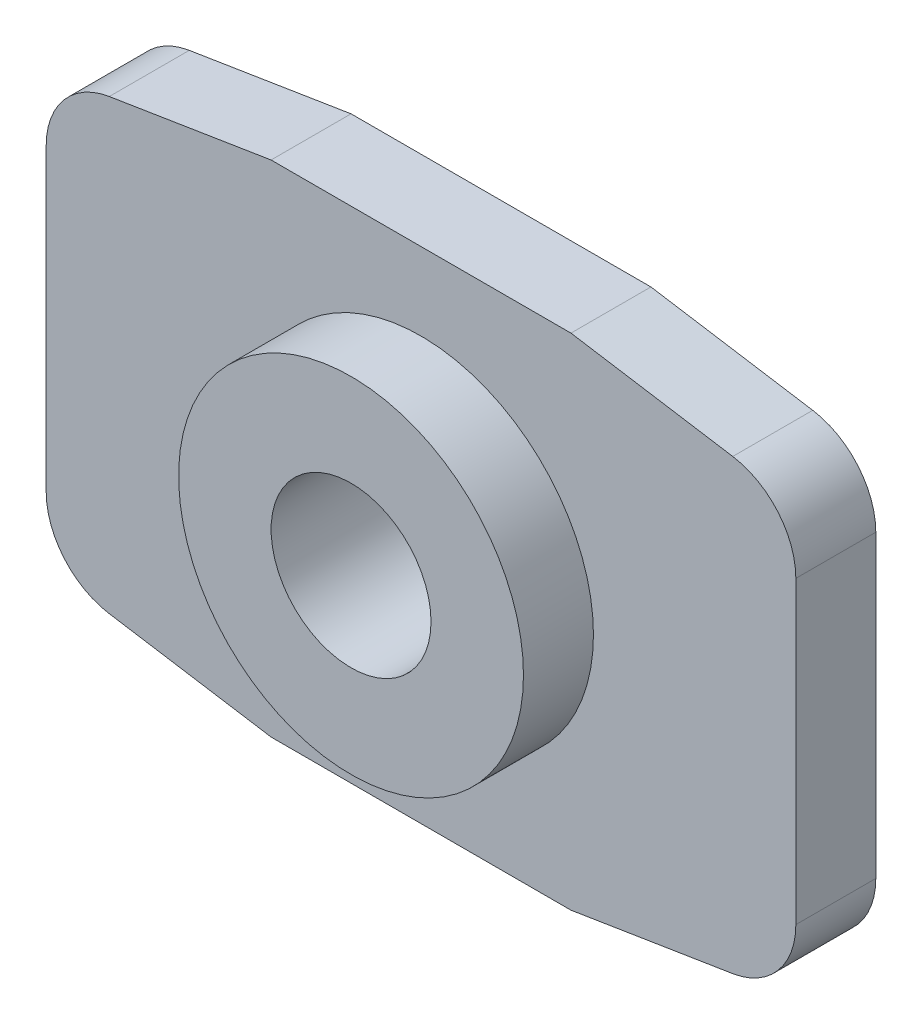
ISO-10303-21;
HEADER;
FILE_DESCRIPTION(('STEP AP214'),'2;1');
FILE_NAME('part.step','',(''),(''),'','','');
FILE_SCHEMA(('AUTOMOTIVE_DESIGN { 1 0 10303 214 1 1 1 1 }'));
ENDSEC;
DATA;
#1=APPLICATION_CONTEXT('core data for automotive mechanical design processes');
#2=APPLICATION_PROTOCOL_DEFINITION('international standard','automotive_design',2000,#1);
#3=PRODUCT_CONTEXT('',#1,'mechanical');
#4=PRODUCT('Part','Part','',(#3));
#5=PRODUCT_RELATED_PRODUCT_CATEGORY('part','',(#4));
#6=PRODUCT_DEFINITION_FORMATION('','',#4);
#7=PRODUCT_DEFINITION_CONTEXT('part definition',#1,'design');
#8=PRODUCT_DEFINITION('design','',#6,#7);
#9=PRODUCT_DEFINITION_SHAPE('','',#8);
#10=(LENGTH_UNIT() NAMED_UNIT(*) SI_UNIT(.MILLI.,.METRE.));
#11=(NAMED_UNIT(*) PLANE_ANGLE_UNIT() SI_UNIT($,.RADIAN.));
#12=(NAMED_UNIT(*) SI_UNIT($,.STERADIAN.) SOLID_ANGLE_UNIT());
#13=UNCERTAINTY_MEASURE_WITH_UNIT(LENGTH_MEASURE(1.E-05),#10,'distance_accuracy_value','');
#14=(GEOMETRIC_REPRESENTATION_CONTEXT(3) GLOBAL_UNCERTAINTY_ASSIGNED_CONTEXT((#13)) GLOBAL_UNIT_ASSIGNED_CONTEXT((#10,
#11,#12)) REPRESENTATION_CONTEXT('',''));
#15=CARTESIAN_POINT('',(0.,0.,0.));
#16=DIRECTION('',(0.,0.,1.));
#17=DIRECTION('',(1.,0.,0.));
#18=AXIS2_PLACEMENT_3D('',#15,#16,#17);
#19=CARTESIAN_POINT('',(6.,3.,1.6));
#20=DIRECTION('',(0.,0.,1.));
#21=DIRECTION('',(1.,0.,0.));
#22=AXIS2_PLACEMENT_3D('',#19,#20,#21);
#23=PLANE('',#22);
#24=CARTESIAN_POINT('',(6.,3.,1.6));
#25=DIRECTION('',(0.,0.,1.));
#26=DIRECTION('',(1.,0.,0.));
#27=AXIS2_PLACEMENT_3D('',#24,#25,#26);
#28=CIRCLE('',#27,1.5);
#29=CARTESIAN_POINT('',(7.5,3.,1.6));
#30=VERTEX_POINT('',#29);
#31=CARTESIAN_POINT('',(6.23739675280407,4.48109512920611,1.6));
#32=VERTEX_POINT('',#31);
#33=EDGE_CURVE('E199',#30,#32,#28,.T.);
#34=ORIENTED_EDGE('',*,*,#33,.T.);
#35=DIRECTION('',(-0.987396752804077,0.158264501869385,0.));
#36=VECTOR('',#35,1.);
#37=CARTESIAN_POINT('',(6.23739675280407,4.48109512920611,1.6));
#38=LINE('',#37,#36);
#39=CARTESIAN_POINT('',(3.,5.,1.6));
#40=VERTEX_POINT('',#39);
#41=EDGE_CURVE('E108',#32,#40,#38,.T.);
#42=ORIENTED_EDGE('',*,*,#41,.T.);
#43=DIRECTION('',(-1.,0.,0.));
#44=VECTOR('',#43,1.);
#45=CARTESIAN_POINT('',(-3.,5.,1.6));
#46=LINE('',#45,#44);
#47=CARTESIAN_POINT('',(-3.,5.,1.6));
#48=VERTEX_POINT('',#47);
#49=EDGE_CURVE('E238',#40,#48,#46,.T.);
#50=ORIENTED_EDGE('',*,*,#49,.T.);
#51=DIRECTION('',(-0.987396752804077,-0.158264501869386,0.));
#52=VECTOR('',#51,1.);
#53=CARTESIAN_POINT('',(-6.23739675280407,4.48109512920611,1.6));
#54=LINE('',#53,#52);
#55=CARTESIAN_POINT('',(-6.23739675280407,4.48109512920611,1.6));
#56=VERTEX_POINT('',#55);
#57=EDGE_CURVE('E257',#48,#56,#54,.T.);
#58=ORIENTED_EDGE('',*,*,#57,.T.);
#59=CARTESIAN_POINT('',(-6.,3.,1.6));
#60=DIRECTION('',(0.,0.,1.));
#61=DIRECTION('',(-1.,0.,0.));
#62=AXIS2_PLACEMENT_3D('',#59,#60,#61);
#63=CIRCLE('',#62,1.5);
#64=CARTESIAN_POINT('',(-7.5,3.,1.6));
#65=VERTEX_POINT('',#64);
#66=EDGE_CURVE('E253',#56,#65,#63,.T.);
#67=ORIENTED_EDGE('',*,*,#66,.T.);
#68=DIRECTION('',(0.,-1.,0.));
#69=VECTOR('',#68,1.);
#70=CARTESIAN_POINT('',(-7.5,-3.,1.6));
#71=LINE('',#70,#69);
#72=CARTESIAN_POINT('',(-7.5,-3.,1.6));
#73=VERTEX_POINT('',#72);
#74=EDGE_CURVE('E256',#65,#73,#71,.T.);
#75=ORIENTED_EDGE('',*,*,#74,.T.);
#76=CARTESIAN_POINT('',(-6.,-3.,1.6));
#77=DIRECTION('',(0.,0.,1.));
#78=DIRECTION('',(1.,0.,0.));
#79=AXIS2_PLACEMENT_3D('',#76,#77,#78);
#80=CIRCLE('',#79,1.5);
#81=CARTESIAN_POINT('',(-6.23739675280407,-4.48109512920612,1.6));
#82=VERTEX_POINT('',#81);
#83=EDGE_CURVE('E262',#73,#82,#80,.T.);
#84=ORIENTED_EDGE('',*,*,#83,.T.);
#85=DIRECTION('',(0.987396752804077,-0.158264501869385,0.));
#86=VECTOR('',#85,1.);
#87=CARTESIAN_POINT('',(-6.23739675280407,-4.48109512920612,1.6));
#88=LINE('',#87,#86);
#89=CARTESIAN_POINT('',(-3.,-5.,1.6));
#90=VERTEX_POINT('',#89);
#91=EDGE_CURVE('E270',#82,#90,#88,.T.);
#92=ORIENTED_EDGE('',*,*,#91,.T.);
#93=DIRECTION('',(1.,0.,0.));
#94=VECTOR('',#93,1.);
#95=CARTESIAN_POINT('',(-3.,-5.,1.6));
#96=LINE('',#95,#94);
#97=CARTESIAN_POINT('',(3.,-5.,1.6));
#98=VERTEX_POINT('',#97);
#99=EDGE_CURVE('E139',#90,#98,#96,.T.);
#100=ORIENTED_EDGE('',*,*,#99,.T.);
#101=DIRECTION('',(0.987396752804077,0.158264501869385,0.));
#102=VECTOR('',#101,1.);
#103=CARTESIAN_POINT('',(6.23739675280407,-4.48109512920611,1.6));
#104=LINE('',#103,#102);
#105=CARTESIAN_POINT('',(6.23739675280407,-4.48109512920612,1.6));
#106=VERTEX_POINT('',#105);
#107=EDGE_CURVE('E133',#98,#106,#104,.T.);
#108=ORIENTED_EDGE('',*,*,#107,.T.);
#109=CARTESIAN_POINT('',(6.,-3.,1.6));
#110=DIRECTION('',(0.,0.,1.));
#111=DIRECTION('',(-1.,0.,0.));
#112=AXIS2_PLACEMENT_3D('',#109,#110,#111);
#113=CIRCLE('',#112,1.5);
#114=CARTESIAN_POINT('',(7.5,-3.,1.6));
#115=VERTEX_POINT('',#114);
#116=EDGE_CURVE('E137',#106,#115,#113,.T.);
#117=ORIENTED_EDGE('',*,*,#116,.T.);
#118=DIRECTION('',(0.,1.,0.));
#119=VECTOR('',#118,1.);
#120=CARTESIAN_POINT('',(7.5,-3.,1.6));
#121=LINE('',#120,#119);
#122=EDGE_CURVE('E53',#115,#30,#121,.T.);
#123=ORIENTED_EDGE('',*,*,#122,.T.);
#124=EDGE_LOOP('',(#34,#42,#50,#58,#67,#75,#84,#92,#100,#108,#117,#123));
#125=FACE_BOUND('',#124,.T.);
#126=CARTESIAN_POINT('',(0.,0.,1.6));
#127=DIRECTION('',(0.,0.,1.));
#128=DIRECTION('',(1.,0.,0.));
#129=AXIS2_PLACEMENT_3D('',#126,#127,#128);
#130=CIRCLE('',#129,3.45);
#131=CARTESIAN_POINT('',(3.45,0.,1.6));
#132=VERTEX_POINT('',#131);
#133=EDGE_CURVE('E337',#132,#132,#130,.T.);
#134=ORIENTED_EDGE('',*,*,#133,.F.);
#135=EDGE_LOOP('',(#134));
#136=FACE_BOUND('',#135,.T.);
#137=ADVANCED_FACE('F35',(#125,#136),#23,.T.);
#138=CARTESIAN_POINT('',(6.,3.,1.6));
#139=DIRECTION('',(0.,0.,-1.));
#140=DIRECTION('',(-1.,0.,0.));
#141=AXIS2_PLACEMENT_3D('',#138,#139,#140);
#142=CYLINDRICAL_SURFACE('',#141,1.5);
#143=CARTESIAN_POINT('',(6.,3.,0.));
#144=DIRECTION('',(0.,0.,1.));
#145=DIRECTION('',(1.,0.,0.));
#146=AXIS2_PLACEMENT_3D('',#143,#144,#145);
#147=CIRCLE('',#146,1.5);
#148=CARTESIAN_POINT('',(7.5,3.,0.));
#149=VERTEX_POINT('',#148);
#150=CARTESIAN_POINT('',(6.23739675280407,4.48109512920611,0.));
#151=VERTEX_POINT('',#150);
#152=EDGE_CURVE('E164',#149,#151,#147,.T.);
#153=ORIENTED_EDGE('',*,*,#152,.T.);
#154=DIRECTION('',(0.,0.,-1.));
#155=VECTOR('',#154,1.);
#156=CARTESIAN_POINT('',(6.23739675280407,4.48109512920611,1.6));
#157=LINE('',#156,#155);
#158=EDGE_CURVE('E11',#32,#151,#157,.T.);
#159=ORIENTED_EDGE('',*,*,#158,.F.);
#160=ORIENTED_EDGE('',*,*,#33,.F.);
#161=DIRECTION('',(0.,0.,-1.));
#162=VECTOR('',#161,1.);
#163=CARTESIAN_POINT('',(7.5,3.,1.6));
#164=LINE('',#163,#162);
#165=EDGE_CURVE('E160',#30,#149,#164,.T.);
#166=ORIENTED_EDGE('',*,*,#165,.T.);
#167=EDGE_LOOP('',(#153,#159,#160,#166));
#168=FACE_BOUND('',#167,.T.);
#169=ADVANCED_FACE('F37',(#168),#142,.T.);
#170=CARTESIAN_POINT('',(6.23739675280407,4.48109512920611,1.6));
#171=DIRECTION('',(-0.158264501869385,-0.987396752804077,0.));
#172=DIRECTION('',(0.987396752804077,-0.158264501869385,0.));
#173=AXIS2_PLACEMENT_3D('',#170,#171,#172);
#174=PLANE('',#173);
#175=DIRECTION('',(-0.987396752804077,0.158264501869385,0.));
#176=VECTOR('',#175,1.);
#177=CARTESIAN_POINT('',(6.23739675280407,4.48109512920611,0.));
#178=LINE('',#177,#176);
#179=CARTESIAN_POINT('',(3.,5.,0.));
#180=VERTEX_POINT('',#179);
#181=EDGE_CURVE('E168',#151,#180,#178,.T.);
#182=ORIENTED_EDGE('',*,*,#181,.T.);
#183=DIRECTION('',(0.,0.,-1.));
#184=VECTOR('',#183,1.);
#185=CARTESIAN_POINT('',(3.,5.,1.6));
#186=LINE('',#185,#184);
#187=EDGE_CURVE('E45',#40,#180,#186,.T.);
#188=ORIENTED_EDGE('',*,*,#187,.F.);
#189=ORIENTED_EDGE('',*,*,#41,.F.);
#190=ORIENTED_EDGE('',*,*,#158,.T.);
#191=EDGE_LOOP('',(#182,#188,#189,#190));
#192=FACE_BOUND('',#191,.T.);
#193=ADVANCED_FACE('F325',(#192),#174,.F.);
#194=CARTESIAN_POINT('',(-3.,5.,1.6));
#195=DIRECTION('',(0.,-1.,0.));
#196=DIRECTION('',(0.,0.,-1.));
#197=AXIS2_PLACEMENT_3D('',#194,#195,#196);
#198=PLANE('',#197);
#199=DIRECTION('',(-1.,0.,0.));
#200=VECTOR('',#199,1.);
#201=CARTESIAN_POINT('',(-3.,5.,0.));
#202=LINE('',#201,#200);
#203=CARTESIAN_POINT('',(-3.,5.,0.));
#204=VERTEX_POINT('',#203);
#205=EDGE_CURVE('E172',#180,#204,#202,.T.);
#206=ORIENTED_EDGE('',*,*,#205,.T.);
#207=DIRECTION('',(0.,0.,-1.));
#208=VECTOR('',#207,1.);
#209=CARTESIAN_POINT('',(-3.,5.,1.6));
#210=LINE('',#209,#208);
#211=EDGE_CURVE('E225',#48,#204,#210,.T.);
#212=ORIENTED_EDGE('',*,*,#211,.F.);
#213=ORIENTED_EDGE('',*,*,#49,.F.);
#214=ORIENTED_EDGE('',*,*,#187,.T.);
#215=EDGE_LOOP('',(#206,#212,#213,#214));
#216=FACE_BOUND('',#215,.T.);
#217=ADVANCED_FACE('F236',(#216),#198,.F.);
#218=CARTESIAN_POINT('',(-6.23739675280407,4.48109512920611,1.6));
#219=DIRECTION('',(0.158264501869386,-0.987396752804077,0.));
#220=DIRECTION('',(0.987396752804077,0.158264501869386,0.));
#221=AXIS2_PLACEMENT_3D('',#218,#219,#220);
#222=PLANE('',#221);
#223=DIRECTION('',(-0.987396752804077,-0.158264501869386,0.));
#224=VECTOR('',#223,1.);
#225=CARTESIAN_POINT('',(-6.23739675280407,4.48109512920611,0.));
#226=LINE('',#225,#224);
#227=CARTESIAN_POINT('',(-6.23739675280407,4.48109512920611,0.));
#228=VERTEX_POINT('',#227);
#229=EDGE_CURVE('E175',#204,#228,#226,.T.);
#230=ORIENTED_EDGE('',*,*,#229,.T.);
#231=DIRECTION('',(0.,0.,-1.));
#232=VECTOR('',#231,1.);
#233=CARTESIAN_POINT('',(-6.23739675280407,4.48109512920611,1.6));
#234=LINE('',#233,#232);
#235=EDGE_CURVE('E221',#56,#228,#234,.T.);
#236=ORIENTED_EDGE('',*,*,#235,.F.);
#237=ORIENTED_EDGE('',*,*,#57,.F.);
#238=ORIENTED_EDGE('',*,*,#211,.T.);
#239=EDGE_LOOP('',(#230,#236,#237,#238));
#240=FACE_BOUND('',#239,.T.);
#241=ADVANCED_FACE('F247',(#240),#222,.F.);
#242=CARTESIAN_POINT('',(-6.,3.,1.6));
#243=DIRECTION('',(0.,0.,-1.));
#244=DIRECTION('',(-1.,0.,0.));
#245=AXIS2_PLACEMENT_3D('',#242,#243,#244);
#246=CYLINDRICAL_SURFACE('',#245,1.5);
#247=CARTESIAN_POINT('',(-6.,3.,0.));
#248=DIRECTION('',(0.,0.,1.));
#249=DIRECTION('',(-1.,0.,0.));
#250=AXIS2_PLACEMENT_3D('',#247,#248,#249);
#251=CIRCLE('',#250,1.5);
#252=CARTESIAN_POINT('',(-7.5,3.,0.));
#253=VERTEX_POINT('',#252);
#254=EDGE_CURVE('E178',#228,#253,#251,.T.);
#255=ORIENTED_EDGE('',*,*,#254,.T.);
#256=DIRECTION('',(0.,0.,-1.));
#257=VECTOR('',#256,1.);
#258=CARTESIAN_POINT('',(-7.5,3.,1.6));
#259=LINE('',#258,#257);
#260=EDGE_CURVE('E217',#65,#253,#259,.T.);
#261=ORIENTED_EDGE('',*,*,#260,.F.);
#262=ORIENTED_EDGE('',*,*,#66,.F.);
#263=ORIENTED_EDGE('',*,*,#235,.T.);
#264=EDGE_LOOP('',(#255,#261,#262,#263));
#265=FACE_BOUND('',#264,.T.);
#266=ADVANCED_FACE('F251',(#265),#246,.T.);
#267=CARTESIAN_POINT('',(-7.5,-3.,1.6));
#268=DIRECTION('',(1.,0.,0.));
#269=DIRECTION('',(0.,0.,-1.));
#270=AXIS2_PLACEMENT_3D('',#267,#268,#269);
#271=PLANE('',#270);
#272=DIRECTION('',(0.,-1.,0.));
#273=VECTOR('',#272,1.);
#274=CARTESIAN_POINT('',(-7.5,-3.,0.));
#275=LINE('',#274,#273);
#276=CARTESIAN_POINT('',(-7.5,-3.,0.));
#277=VERTEX_POINT('',#276);
#278=EDGE_CURVE('E181',#253,#277,#275,.T.);
#279=ORIENTED_EDGE('',*,*,#278,.T.);
#280=DIRECTION('',(0.,0.,-1.));
#281=VECTOR('',#280,1.);
#282=CARTESIAN_POINT('',(-7.5,-3.,1.6));
#283=LINE('',#282,#281);
#284=EDGE_CURVE('E214',#73,#277,#283,.T.);
#285=ORIENTED_EDGE('',*,*,#284,.F.);
#286=ORIENTED_EDGE('',*,*,#74,.F.);
#287=ORIENTED_EDGE('',*,*,#260,.T.);
#288=EDGE_LOOP('',(#279,#285,#286,#287));
#289=FACE_BOUND('',#288,.T.);
#290=ADVANCED_FACE('F391',(#289),#271,.F.);
#291=CARTESIAN_POINT('',(-6.,-3.,1.6));
#292=DIRECTION('',(0.,0.,-1.));
#293=DIRECTION('',(-1.,0.,0.));
#294=AXIS2_PLACEMENT_3D('',#291,#292,#293);
#295=CYLINDRICAL_SURFACE('',#294,1.5);
#296=CARTESIAN_POINT('',(-6.,-3.,0.));
#297=DIRECTION('',(0.,0.,1.));
#298=DIRECTION('',(1.,0.,0.));
#299=AXIS2_PLACEMENT_3D('',#296,#297,#298);
#300=CIRCLE('',#299,1.5);
#301=CARTESIAN_POINT('',(-6.23739675280407,-4.48109512920612,0.));
#302=VERTEX_POINT('',#301);
#303=EDGE_CURVE('E184',#277,#302,#300,.T.);
#304=ORIENTED_EDGE('',*,*,#303,.T.);
#305=DIRECTION('',(0.,0.,-1.));
#306=VECTOR('',#305,1.);
#307=CARTESIAN_POINT('',(-6.23739675280407,-4.48109512920612,1.6));
#308=LINE('',#307,#306);
#309=EDGE_CURVE('E210',#82,#302,#308,.T.);
#310=ORIENTED_EDGE('',*,*,#309,.F.);
#311=ORIENTED_EDGE('',*,*,#83,.F.);
#312=ORIENTED_EDGE('',*,*,#284,.T.);
#313=EDGE_LOOP('',(#304,#310,#311,#312));
#314=FACE_BOUND('',#313,.T.);
#315=ADVANCED_FACE('F387',(#314),#295,.T.);
#316=CARTESIAN_POINT('',(-6.23739675280407,-4.48109512920612,1.6));
#317=DIRECTION('',(0.158264501869385,0.987396752804077,0.));
#318=DIRECTION('',(-0.987396752804077,0.158264501869385,0.));
#319=AXIS2_PLACEMENT_3D('',#316,#317,#318);
#320=PLANE('',#319);
#321=DIRECTION('',(0.987396752804077,-0.158264501869385,0.));
#322=VECTOR('',#321,1.);
#323=CARTESIAN_POINT('',(-6.23739675280407,-4.48109512920612,0.));
#324=LINE('',#323,#322);
#325=CARTESIAN_POINT('',(-3.,-5.,0.));
#326=VERTEX_POINT('',#325);
#327=EDGE_CURVE('E187',#302,#326,#324,.T.);
#328=ORIENTED_EDGE('',*,*,#327,.T.);
#329=DIRECTION('',(0.,0.,-1.));
#330=VECTOR('',#329,1.);
#331=CARTESIAN_POINT('',(-3.,-5.,1.6));
#332=LINE('',#331,#330);
#333=EDGE_CURVE('E206',#90,#326,#332,.T.);
#334=ORIENTED_EDGE('',*,*,#333,.F.);
#335=ORIENTED_EDGE('',*,*,#91,.F.);
#336=ORIENTED_EDGE('',*,*,#309,.T.);
#337=EDGE_LOOP('',(#328,#334,#335,#336));
#338=FACE_BOUND('',#337,.T.);
#339=ADVANCED_FACE('F298',(#338),#320,.F.);
#340=CARTESIAN_POINT('',(-3.,-5.,1.6));
#341=DIRECTION('',(0.,1.,0.));
#342=DIRECTION('',(0.,0.,1.));
#343=AXIS2_PLACEMENT_3D('',#340,#341,#342);
#344=PLANE('',#343);
#345=DIRECTION('',(1.,0.,0.));
#346=VECTOR('',#345,1.);
#347=CARTESIAN_POINT('',(-3.,-5.,0.));
#348=LINE('',#347,#346);
#349=CARTESIAN_POINT('',(3.,-5.,0.));
#350=VERTEX_POINT('',#349);
#351=EDGE_CURVE('E190',#326,#350,#348,.T.);
#352=ORIENTED_EDGE('',*,*,#351,.T.);
#353=DIRECTION('',(0.,0.,-1.));
#354=VECTOR('',#353,1.);
#355=CARTESIAN_POINT('',(3.,-5.,1.6));
#356=LINE('',#355,#354);
#357=EDGE_CURVE('E150',#98,#350,#356,.T.);
#358=ORIENTED_EDGE('',*,*,#357,.F.);
#359=ORIENTED_EDGE('',*,*,#99,.F.);
#360=ORIENTED_EDGE('',*,*,#333,.T.);
#361=EDGE_LOOP('',(#352,#358,#359,#360));
#362=FACE_BOUND('',#361,.T.);
#363=ADVANCED_FACE('F294',(#362),#344,.F.);
#364=CARTESIAN_POINT('',(6.23739675280407,-4.48109512920611,1.6));
#365=DIRECTION('',(-0.158264501869385,0.987396752804077,0.));
#366=DIRECTION('',(-0.987396752804077,-0.158264501869385,0.));
#367=AXIS2_PLACEMENT_3D('',#364,#365,#366);
#368=PLANE('',#367);
#369=DIRECTION('',(0.987396752804077,0.158264501869385,0.));
#370=VECTOR('',#369,1.);
#371=CARTESIAN_POINT('',(6.23739675280407,-4.48109512920611,0.));
#372=LINE('',#371,#370);
#373=CARTESIAN_POINT('',(6.23739675280407,-4.48109512920612,0.));
#374=VERTEX_POINT('',#373);
#375=EDGE_CURVE('E148',#350,#374,#372,.T.);
#376=ORIENTED_EDGE('',*,*,#375,.T.);
#377=DIRECTION('',(0.,0.,-1.));
#378=VECTOR('',#377,1.);
#379=CARTESIAN_POINT('',(6.23739675280407,-4.48109512920612,1.6));
#380=LINE('',#379,#378);
#381=EDGE_CURVE('E145',#106,#374,#380,.T.);
#382=ORIENTED_EDGE('',*,*,#381,.F.);
#383=ORIENTED_EDGE('',*,*,#107,.F.);
#384=ORIENTED_EDGE('',*,*,#357,.T.);
#385=EDGE_LOOP('',(#376,#382,#383,#384));
#386=FACE_BOUND('',#385,.T.);
#387=ADVANCED_FACE('F146',(#386),#368,.F.);
#388=CARTESIAN_POINT('',(6.,-3.,1.6));
#389=DIRECTION('',(0.,0.,-1.));
#390=DIRECTION('',(-1.,0.,0.));
#391=AXIS2_PLACEMENT_3D('',#388,#389,#390);
#392=CYLINDRICAL_SURFACE('',#391,1.5);
#393=CARTESIAN_POINT('',(6.,-3.,0.));
#394=DIRECTION('',(0.,0.,1.));
#395=DIRECTION('',(-1.,0.,0.));
#396=AXIS2_PLACEMENT_3D('',#393,#394,#395);
#397=CIRCLE('',#396,1.5);
#398=CARTESIAN_POINT('',(7.5,-3.,0.));
#399=VERTEX_POINT('',#398);
#400=EDGE_CURVE('E94',#374,#399,#397,.T.);
#401=ORIENTED_EDGE('',*,*,#400,.T.);
#402=DIRECTION('',(0.,0.,-1.));
#403=VECTOR('',#402,1.);
#404=CARTESIAN_POINT('',(7.5,-3.,1.6));
#405=LINE('',#404,#403);
#406=EDGE_CURVE('E151',#115,#399,#405,.T.);
#407=ORIENTED_EDGE('',*,*,#406,.F.);
#408=ORIENTED_EDGE('',*,*,#116,.F.);
#409=ORIENTED_EDGE('',*,*,#381,.T.);
#410=EDGE_LOOP('',(#401,#407,#408,#409));
#411=FACE_BOUND('',#410,.T.);
#412=ADVANCED_FACE('F153',(#411),#392,.T.);
#413=CARTESIAN_POINT('',(7.5,-3.,1.6));
#414=DIRECTION('',(-1.,0.,0.));
#415=DIRECTION('',(0.,-1.,0.));
#416=AXIS2_PLACEMENT_3D('',#413,#414,#415);
#417=PLANE('',#416);
#418=DIRECTION('',(0.,1.,0.));
#419=VECTOR('',#418,1.);
#420=CARTESIAN_POINT('',(7.5,-3.,0.));
#421=LINE('',#420,#419);
#422=EDGE_CURVE('E100',#399,#149,#421,.T.);
#423=ORIENTED_EDGE('',*,*,#422,.T.);
#424=ORIENTED_EDGE('',*,*,#165,.F.);
#425=ORIENTED_EDGE('',*,*,#122,.F.);
#426=ORIENTED_EDGE('',*,*,#406,.T.);
#427=EDGE_LOOP('',(#423,#424,#425,#426));
#428=FACE_BOUND('',#427,.T.);
#429=ADVANCED_FACE('F282',(#428),#417,.F.);
#430=CARTESIAN_POINT('',(6.,3.,0.));
#431=DIRECTION('',(0.,0.,1.));
#432=DIRECTION('',(1.,0.,0.));
#433=AXIS2_PLACEMENT_3D('',#430,#431,#432);
#434=PLANE('',#433);
#435=CARTESIAN_POINT('',(0.,0.,0.));
#436=DIRECTION('',(0.,0.,1.));
#437=DIRECTION('',(1.,0.,0.));
#438=AXIS2_PLACEMENT_3D('',#435,#436,#437);
#439=CIRCLE('',#438,1.6);
#440=CARTESIAN_POINT('',(1.6,0.,0.));
#441=VERTEX_POINT('',#440);
#442=EDGE_CURVE('E334',#441,#441,#439,.T.);
#443=ORIENTED_EDGE('',*,*,#442,.T.);
#444=EDGE_LOOP('',(#443));
#445=FACE_BOUND('',#444,.T.);
#446=ORIENTED_EDGE('',*,*,#152,.F.);
#447=ORIENTED_EDGE('',*,*,#422,.F.);
#448=ORIENTED_EDGE('',*,*,#400,.F.);
#449=ORIENTED_EDGE('',*,*,#375,.F.);
#450=ORIENTED_EDGE('',*,*,#351,.F.);
#451=ORIENTED_EDGE('',*,*,#327,.F.);
#452=ORIENTED_EDGE('',*,*,#303,.F.);
#453=ORIENTED_EDGE('',*,*,#278,.F.);
#454=ORIENTED_EDGE('',*,*,#254,.F.);
#455=ORIENTED_EDGE('',*,*,#229,.F.);
#456=ORIENTED_EDGE('',*,*,#205,.F.);
#457=ORIENTED_EDGE('',*,*,#181,.F.);
#458=EDGE_LOOP('',(#446,#447,#448,#449,#450,#451,#452,#453,#454,#455,#456,#457));
#459=FACE_BOUND('',#458,.T.);
#460=ADVANCED_FACE('F242',(#445,#459),#434,.F.);
#461=CARTESIAN_POINT('',(0.,0.,3.));
#462=DIRECTION('',(0.,0.,-1.));
#463=DIRECTION('',(-1.,0.,0.));
#464=AXIS2_PLACEMENT_3D('',#461,#462,#463);
#465=CYLINDRICAL_SURFACE('',#464,3.45);
#466=CARTESIAN_POINT('',(0.,0.,3.));
#467=DIRECTION('',(0.,0.,1.));
#468=DIRECTION('',(1.,0.,0.));
#469=AXIS2_PLACEMENT_3D('',#466,#467,#468);
#470=CIRCLE('',#469,3.45);
#471=CARTESIAN_POINT('',(3.45,0.,3.));
#472=VERTEX_POINT('',#471);
#473=EDGE_CURVE('E169',#472,#472,#470,.T.);
#474=ORIENTED_EDGE('',*,*,#473,.F.);
#475=EDGE_LOOP('',(#474));
#476=FACE_BOUND('',#475,.T.);
#477=ORIENTED_EDGE('',*,*,#133,.T.);
#478=EDGE_LOOP('',(#477));
#479=FACE_BOUND('',#478,.T.);
#480=ADVANCED_FACE('F281',(#476,#479),#465,.T.);
#481=CARTESIAN_POINT('',(0.,0.,3.));
#482=DIRECTION('',(0.,0.,1.));
#483=DIRECTION('',(1.,0.,0.));
#484=AXIS2_PLACEMENT_3D('',#481,#482,#483);
#485=PLANE('',#484);
#486=CARTESIAN_POINT('',(0.,0.,3.));
#487=DIRECTION('',(0.,0.,1.));
#488=DIRECTION('',(1.,0.,0.));
#489=AXIS2_PLACEMENT_3D('',#486,#487,#488);
#490=CIRCLE('',#489,1.6);
#491=CARTESIAN_POINT('',(1.6,0.,3.));
#492=VERTEX_POINT('',#491);
#493=EDGE_CURVE('E338',#492,#492,#490,.T.);
#494=ORIENTED_EDGE('',*,*,#493,.F.);
#495=EDGE_LOOP('',(#494));
#496=FACE_BOUND('',#495,.T.);
#497=ORIENTED_EDGE('',*,*,#473,.T.);
#498=EDGE_LOOP('',(#497));
#499=FACE_BOUND('',#498,.T.);
#500=ADVANCED_FACE('F311',(#496,#499),#485,.T.);
#501=CARTESIAN_POINT('',(0.,0.,3.));
#502=DIRECTION('',(0.,0.,1.));
#503=DIRECTION('',(1.,0.,0.));
#504=AXIS2_PLACEMENT_3D('',#501,#502,#503);
#505=CYLINDRICAL_SURFACE('',#504,1.6);
#506=ORIENTED_EDGE('',*,*,#442,.F.);
#507=EDGE_LOOP('',(#506));
#508=FACE_BOUND('',#507,.T.);
#509=ORIENTED_EDGE('',*,*,#493,.T.);
#510=EDGE_LOOP('',(#509));
#511=FACE_BOUND('',#510,.T.);
#512=ADVANCED_FACE('F274',(#508,#511),#505,.F.);
#513=CLOSED_SHELL('',(#137,#169,#193,#217,#241,#266,#290,#315,#339,#363,#387,#412,#429,#460,
#480,#500,#512));
#514=MANIFOLD_SOLID_BREP('B2',#513);
#515=ADVANCED_BREP_SHAPE_REPRESENTATION('',(#18,#514),#14);
#516=SHAPE_DEFINITION_REPRESENTATION(#9,#515);
ENDSEC;
END-ISO-10303-21;
